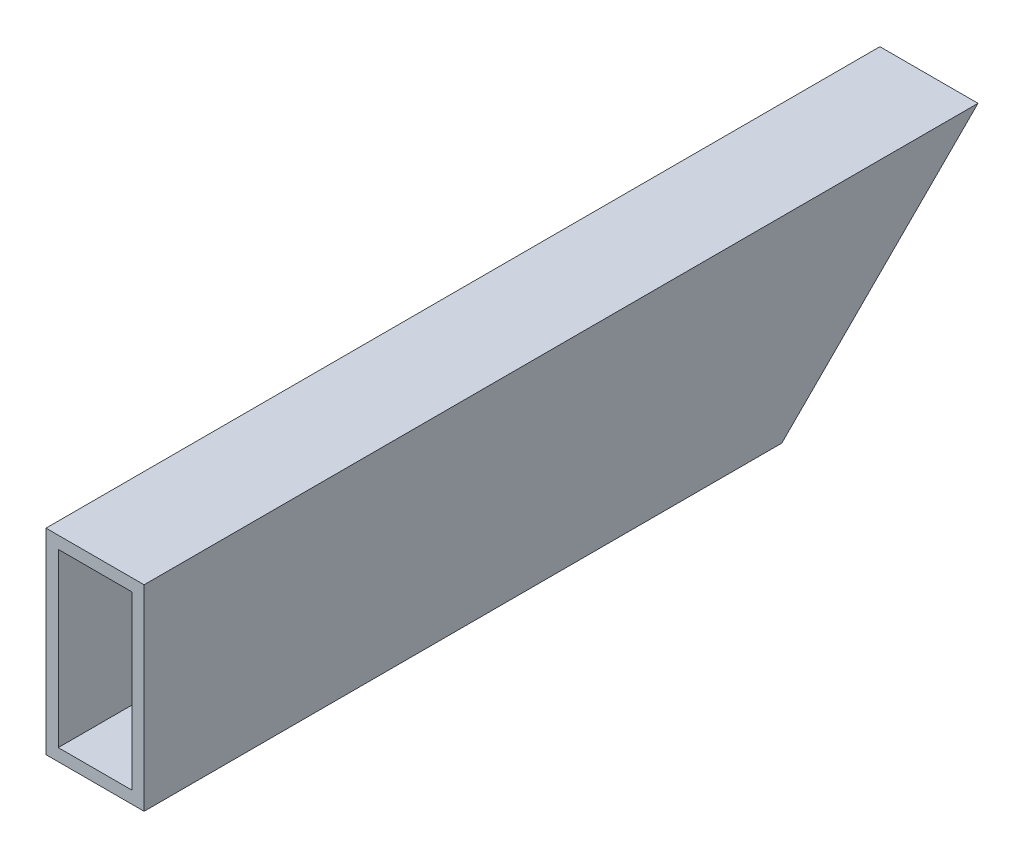
ISO-10303-21;
HEADER;
FILE_DESCRIPTION(('STEP AP214'),'2;1');
FILE_NAME('part.step','',(''),(''),'','','');
FILE_SCHEMA(('AUTOMOTIVE_DESIGN { 1 0 10303 214 1 1 1 1 }'));
ENDSEC;
DATA;
#1=APPLICATION_CONTEXT('core data for automotive mechanical design processes');
#2=APPLICATION_PROTOCOL_DEFINITION('international standard','automotive_design',2000,#1);
#3=PRODUCT_CONTEXT('',#1,'mechanical');
#4=PRODUCT('Part','Part','',(#3));
#5=PRODUCT_RELATED_PRODUCT_CATEGORY('part','',(#4));
#6=PRODUCT_DEFINITION_FORMATION('','',#4);
#7=PRODUCT_DEFINITION_CONTEXT('part definition',#1,'design');
#8=PRODUCT_DEFINITION('design','',#6,#7);
#9=PRODUCT_DEFINITION_SHAPE('','',#8);
#10=(LENGTH_UNIT() NAMED_UNIT(*) SI_UNIT(.MILLI.,.METRE.));
#11=(NAMED_UNIT(*) PLANE_ANGLE_UNIT() SI_UNIT($,.RADIAN.));
#12=(NAMED_UNIT(*) SI_UNIT($,.STERADIAN.) SOLID_ANGLE_UNIT());
#13=UNCERTAINTY_MEASURE_WITH_UNIT(LENGTH_MEASURE(1.E-05),#10,'distance_accuracy_value','');
#14=(GEOMETRIC_REPRESENTATION_CONTEXT(3) GLOBAL_UNCERTAINTY_ASSIGNED_CONTEXT((#13)) GLOBAL_UNIT_ASSIGNED_CONTEXT((#10,
#11,#12)) REPRESENTATION_CONTEXT('',''));
#15=CARTESIAN_POINT('',(0.,0.,0.));
#16=DIRECTION('',(0.,0.,1.));
#17=DIRECTION('',(1.,0.,0.));
#18=AXIS2_PLACEMENT_3D('',#15,#16,#17);
#19=CARTESIAN_POINT('',(0.,0.,215.9));
#20=DIRECTION('',(0.,0.,1.));
#21=DIRECTION('',(1.,0.,0.));
#22=AXIS2_PLACEMENT_3D('',#19,#20,#21);
#23=PLANE('',#22);
#24=DIRECTION('',(0.,-1.,0.));
#25=VECTOR('',#24,1.);
#26=CARTESIAN_POINT('',(-25.4,50.8,215.9));
#27=LINE('',#26,#25);
#28=CARTESIAN_POINT('',(-25.4,50.8,215.9));
#29=VERTEX_POINT('',#28);
#30=CARTESIAN_POINT('',(-25.4,0.,215.9));
#31=VERTEX_POINT('',#30);
#32=EDGE_CURVE('E128',#29,#31,#27,.T.);
#33=ORIENTED_EDGE('',*,*,#32,.T.);
#34=DIRECTION('',(1.,0.,0.));
#35=VECTOR('',#34,1.);
#36=CARTESIAN_POINT('',(-25.4,0.,215.9));
#37=LINE('',#36,#35);
#38=CARTESIAN_POINT('',(0.,0.,215.9));
#39=VERTEX_POINT('',#38);
#40=EDGE_CURVE('E116',#31,#39,#37,.T.);
#41=ORIENTED_EDGE('',*,*,#40,.T.);
#42=DIRECTION('',(0.,1.,0.));
#43=VECTOR('',#42,1.);
#44=CARTESIAN_POINT('',(0.,50.8,215.9));
#45=LINE('',#44,#43);
#46=CARTESIAN_POINT('',(0.,50.8,215.9));
#47=VERTEX_POINT('',#46);
#48=EDGE_CURVE('E131',#39,#47,#45,.T.);
#49=ORIENTED_EDGE('',*,*,#48,.T.);
#50=DIRECTION('',(-1.,0.,0.));
#51=VECTOR('',#50,1.);
#52=CARTESIAN_POINT('',(-25.4,50.8,215.9));
#53=LINE('',#52,#51);
#54=EDGE_CURVE('E125',#47,#29,#53,.T.);
#55=ORIENTED_EDGE('',*,*,#54,.T.);
#56=EDGE_LOOP('',(#33,#41,#49,#55));
#57=FACE_BOUND('',#56,.T.);
#58=DIRECTION('',(1.,0.,0.));
#59=VECTOR('',#58,1.);
#60=CARTESIAN_POINT('',(-22.225,3.175,215.9));
#61=LINE('',#60,#59);
#62=CARTESIAN_POINT('',(-22.225,3.175,215.9));
#63=VERTEX_POINT('',#62);
#64=CARTESIAN_POINT('',(-3.17499999999999,3.175,215.9));
#65=VERTEX_POINT('',#64);
#66=EDGE_CURVE('E148',#63,#65,#61,.T.);
#67=ORIENTED_EDGE('',*,*,#66,.F.);
#68=DIRECTION('',(0.,-1.,0.));
#69=VECTOR('',#68,1.);
#70=CARTESIAN_POINT('',(-22.225,47.625,215.9));
#71=LINE('',#70,#69);
#72=CARTESIAN_POINT('',(-22.225,47.625,215.9));
#73=VERTEX_POINT('',#72);
#74=EDGE_CURVE('E150',#73,#63,#71,.T.);
#75=ORIENTED_EDGE('',*,*,#74,.F.);
#76=DIRECTION('',(-1.,0.,0.));
#77=VECTOR('',#76,1.);
#78=CARTESIAN_POINT('',(-22.225,47.625,215.9));
#79=LINE('',#78,#77);
#80=CARTESIAN_POINT('',(-3.175,47.625,215.9));
#81=VERTEX_POINT('',#80);
#82=EDGE_CURVE('E144',#81,#73,#79,.T.);
#83=ORIENTED_EDGE('',*,*,#82,.F.);
#84=DIRECTION('',(0.,1.,0.));
#85=VECTOR('',#84,1.);
#86=CARTESIAN_POINT('',(-3.175,47.625,215.9));
#87=LINE('',#86,#85);
#88=EDGE_CURVE('E146',#65,#81,#87,.T.);
#89=ORIENTED_EDGE('',*,*,#88,.F.);
#90=EDGE_LOOP('',(#67,#75,#83,#89));
#91=FACE_BOUND('',#90,.T.);
#92=ADVANCED_FACE('F33',(#57,#91),#23,.T.);
#93=CARTESIAN_POINT('',(-25.4,50.8,215.9));
#94=DIRECTION('',(1.,0.,0.));
#95=DIRECTION('',(0.,0.,-1.));
#96=AXIS2_PLACEMENT_3D('',#93,#94,#95);
#97=PLANE('',#96);
#98=DIRECTION('',(0.,0.,-1.));
#99=VECTOR('',#98,1.);
#100=CARTESIAN_POINT('',(-25.4,50.8,215.9));
#101=LINE('',#100,#99);
#102=CARTESIAN_POINT('',(-25.4,50.8,0.));
#103=VERTEX_POINT('',#102);
#104=EDGE_CURVE('E113',#29,#103,#101,.T.);
#105=ORIENTED_EDGE('',*,*,#104,.T.);
#106=DIRECTION('',(0.,-0.707106781186554,0.707106781186541));
#107=VECTOR('',#106,1.);
#108=CARTESIAN_POINT('',(-25.4,50.8,0.));
#109=LINE('',#108,#107);
#110=CARTESIAN_POINT('',(-25.4,0.,50.7999999999991));
#111=VERTEX_POINT('',#110);
#112=EDGE_CURVE('E99',#103,#111,#109,.T.);
#113=ORIENTED_EDGE('',*,*,#112,.T.);
#114=DIRECTION('',(0.,0.,-1.));
#115=VECTOR('',#114,1.);
#116=CARTESIAN_POINT('',(-25.4,0.,215.9));
#117=LINE('',#116,#115);
#118=EDGE_CURVE('E41',#31,#111,#117,.T.);
#119=ORIENTED_EDGE('',*,*,#118,.F.);
#120=ORIENTED_EDGE('',*,*,#32,.F.);
#121=EDGE_LOOP('',(#105,#113,#119,#120));
#122=FACE_BOUND('',#121,.T.);
#123=ADVANCED_FACE('F35',(#122),#97,.F.);
#124=CARTESIAN_POINT('',(-25.4,0.,215.9));
#125=DIRECTION('',(0.,1.,0.));
#126=DIRECTION('',(0.,0.,1.));
#127=AXIS2_PLACEMENT_3D('',#124,#125,#126);
#128=PLANE('',#127);
#129=ORIENTED_EDGE('',*,*,#118,.T.);
#130=DIRECTION('',(1.,0.,0.));
#131=VECTOR('',#130,1.);
#132=CARTESIAN_POINT('',(-25.4,0.,50.7999999999991));
#133=LINE('',#132,#131);
#134=CARTESIAN_POINT('',(0.,0.,50.7999999999991));
#135=VERTEX_POINT('',#134);
#136=EDGE_CURVE('E96',#111,#135,#133,.T.);
#137=ORIENTED_EDGE('',*,*,#136,.T.);
#138=DIRECTION('',(0.,0.,-1.));
#139=VECTOR('',#138,1.);
#140=CARTESIAN_POINT('',(0.,0.,215.9));
#141=LINE('',#140,#139);
#142=EDGE_CURVE('E118',#39,#135,#141,.T.);
#143=ORIENTED_EDGE('',*,*,#142,.F.);
#144=ORIENTED_EDGE('',*,*,#40,.F.);
#145=EDGE_LOOP('',(#129,#137,#143,#144));
#146=FACE_BOUND('',#145,.T.);
#147=ADVANCED_FACE('F115',(#146),#128,.F.);
#148=CARTESIAN_POINT('',(0.,50.8,215.9));
#149=DIRECTION('',(-1.,0.,0.));
#150=DIRECTION('',(0.,-1.,0.));
#151=AXIS2_PLACEMENT_3D('',#148,#149,#150);
#152=PLANE('',#151);
#153=ORIENTED_EDGE('',*,*,#142,.T.);
#154=DIRECTION('',(0.,-0.707106781186554,0.707106781186541));
#155=VECTOR('',#154,1.);
#156=CARTESIAN_POINT('',(0.,50.8,0.));
#157=LINE('',#156,#155);
#158=CARTESIAN_POINT('',(0.,50.8,0.));
#159=VERTEX_POINT('',#158);
#160=EDGE_CURVE('E102',#159,#135,#157,.T.);
#161=ORIENTED_EDGE('',*,*,#160,.F.);
#162=DIRECTION('',(0.,0.,-1.));
#163=VECTOR('',#162,1.);
#164=CARTESIAN_POINT('',(0.,50.8,215.9));
#165=LINE('',#164,#163);
#166=EDGE_CURVE('E119',#47,#159,#165,.T.);
#167=ORIENTED_EDGE('',*,*,#166,.F.);
#168=ORIENTED_EDGE('',*,*,#48,.F.);
#169=EDGE_LOOP('',(#153,#161,#167,#168));
#170=FACE_BOUND('',#169,.T.);
#171=ADVANCED_FACE('F182',(#170),#152,.F.);
#172=CARTESIAN_POINT('',(-25.4,50.8,215.9));
#173=DIRECTION('',(0.,-1.,0.));
#174=DIRECTION('',(0.,0.,-1.));
#175=AXIS2_PLACEMENT_3D('',#172,#173,#174);
#176=PLANE('',#175);
#177=DIRECTION('',(-1.,0.,0.));
#178=VECTOR('',#177,1.);
#179=CARTESIAN_POINT('',(-25.4,50.8,0.));
#180=LINE('',#179,#178);
#181=EDGE_CURVE('E126',#159,#103,#180,.T.);
#182=ORIENTED_EDGE('',*,*,#181,.T.);
#183=ORIENTED_EDGE('',*,*,#104,.F.);
#184=ORIENTED_EDGE('',*,*,#54,.F.);
#185=ORIENTED_EDGE('',*,*,#166,.T.);
#186=EDGE_LOOP('',(#182,#183,#184,#185));
#187=FACE_BOUND('',#186,.T.);
#188=ADVANCED_FACE('F175',(#187),#176,.F.);
#189=CARTESIAN_POINT('',(-22.225,47.625,215.9));
#190=DIRECTION('',(1.,0.,0.));
#191=DIRECTION('',(0.,1.,0.));
#192=AXIS2_PLACEMENT_3D('',#189,#190,#191);
#193=PLANE('',#192);
#194=DIRECTION('',(0.,-0.707106781186554,0.707106781186541));
#195=VECTOR('',#194,1.);
#196=CARTESIAN_POINT('',(-22.225,-58.7375,109.537499999998));
#197=LINE('',#196,#195);
#198=CARTESIAN_POINT('',(-22.225,47.625,3.17499999999996));
#199=VERTEX_POINT('',#198);
#200=CARTESIAN_POINT('',(-22.225,3.175,47.6249999999992));
#201=VERTEX_POINT('',#200);
#202=EDGE_CURVE('E152',#199,#201,#197,.T.);
#203=ORIENTED_EDGE('',*,*,#202,.F.);
#204=DIRECTION('',(0.,0.,-1.));
#205=VECTOR('',#204,1.);
#206=CARTESIAN_POINT('',(-22.225,47.625,215.9));
#207=LINE('',#206,#205);
#208=EDGE_CURVE('E141',#73,#199,#207,.T.);
#209=ORIENTED_EDGE('',*,*,#208,.F.);
#210=ORIENTED_EDGE('',*,*,#74,.T.);
#211=DIRECTION('',(0.,0.,-1.));
#212=VECTOR('',#211,1.);
#213=CARTESIAN_POINT('',(-22.225,3.175,215.9));
#214=LINE('',#213,#212);
#215=EDGE_CURVE('E129',#63,#201,#214,.T.);
#216=ORIENTED_EDGE('',*,*,#215,.T.);
#217=EDGE_LOOP('',(#203,#209,#210,#216));
#218=FACE_BOUND('',#217,.T.);
#219=ADVANCED_FACE('F173',(#218),#193,.T.);
#220=CARTESIAN_POINT('',(-22.225,3.175,215.9));
#221=DIRECTION('',(0.,1.,0.));
#222=DIRECTION('',(0.,0.,1.));
#223=AXIS2_PLACEMENT_3D('',#220,#221,#222);
#224=PLANE('',#223);
#225=DIRECTION('',(1.,0.,0.));
#226=VECTOR('',#225,1.);
#227=CARTESIAN_POINT('',(-22.225,3.175,47.6249999999992));
#228=LINE('',#227,#226);
#229=CARTESIAN_POINT('',(-3.17499999999999,3.175,47.6249999999992));
#230=VERTEX_POINT('',#229);
#231=EDGE_CURVE('E154',#201,#230,#228,.T.);
#232=ORIENTED_EDGE('',*,*,#231,.F.);
#233=ORIENTED_EDGE('',*,*,#215,.F.);
#234=ORIENTED_EDGE('',*,*,#66,.T.);
#235=DIRECTION('',(0.,0.,-1.));
#236=VECTOR('',#235,1.);
#237=CARTESIAN_POINT('',(-3.17499999999999,3.175,215.9));
#238=LINE('',#237,#236);
#239=EDGE_CURVE('E137',#65,#230,#238,.T.);
#240=ORIENTED_EDGE('',*,*,#239,.T.);
#241=EDGE_LOOP('',(#232,#233,#234,#240));
#242=FACE_BOUND('',#241,.T.);
#243=ADVANCED_FACE('F165',(#242),#224,.T.);
#244=CARTESIAN_POINT('',(-3.175,47.625,215.9));
#245=DIRECTION('',(-1.,0.,0.));
#246=DIRECTION('',(0.,-1.,0.));
#247=AXIS2_PLACEMENT_3D('',#244,#245,#246);
#248=PLANE('',#247);
#249=DIRECTION('',(0.,0.707106781186554,-0.707106781186541));
#250=VECTOR('',#249,1.);
#251=CARTESIAN_POINT('',(-3.17499999999998,-58.7375,109.537499999998));
#252=LINE('',#251,#250);
#253=CARTESIAN_POINT('',(-3.175,47.625,3.17499999999996));
#254=VERTEX_POINT('',#253);
#255=EDGE_CURVE('E47',#230,#254,#252,.T.);
#256=ORIENTED_EDGE('',*,*,#255,.F.);
#257=ORIENTED_EDGE('',*,*,#239,.F.);
#258=ORIENTED_EDGE('',*,*,#88,.T.);
#259=DIRECTION('',(0.,0.,-1.));
#260=VECTOR('',#259,1.);
#261=CARTESIAN_POINT('',(-3.175,47.625,215.9));
#262=LINE('',#261,#260);
#263=EDGE_CURVE('E54',#81,#254,#262,.T.);
#264=ORIENTED_EDGE('',*,*,#263,.T.);
#265=EDGE_LOOP('',(#256,#257,#258,#264));
#266=FACE_BOUND('',#265,.T.);
#267=ADVANCED_FACE('F163',(#266),#248,.T.);
#268=CARTESIAN_POINT('',(-22.225,47.625,215.9));
#269=DIRECTION('',(0.,-1.,0.));
#270=DIRECTION('',(0.,0.,-1.));
#271=AXIS2_PLACEMENT_3D('',#268,#269,#270);
#272=PLANE('',#271);
#273=DIRECTION('',(-1.,0.,0.));
#274=VECTOR('',#273,1.);
#275=CARTESIAN_POINT('',(-22.225,47.625,3.17499999999996));
#276=LINE('',#275,#274);
#277=EDGE_CURVE('E11',#254,#199,#276,.T.);
#278=ORIENTED_EDGE('',*,*,#277,.F.);
#279=ORIENTED_EDGE('',*,*,#263,.F.);
#280=ORIENTED_EDGE('',*,*,#82,.T.);
#281=ORIENTED_EDGE('',*,*,#208,.T.);
#282=EDGE_LOOP('',(#278,#279,#280,#281));
#283=FACE_BOUND('',#282,.T.);
#284=ADVANCED_FACE('F171',(#283),#272,.T.);
#285=CARTESIAN_POINT('',(-25.4,50.8,0.));
#286=DIRECTION('',(0.,0.707106781186541,0.707106781186554));
#287=DIRECTION('',(0.,-0.707106781186554,0.707106781186541));
#288=AXIS2_PLACEMENT_3D('',#285,#286,#287);
#289=PLANE('',#288);
#290=ORIENTED_EDGE('',*,*,#202,.T.);
#291=ORIENTED_EDGE('',*,*,#231,.T.);
#292=ORIENTED_EDGE('',*,*,#255,.T.);
#293=ORIENTED_EDGE('',*,*,#277,.T.);
#294=EDGE_LOOP('',(#290,#291,#292,#293));
#295=FACE_BOUND('',#294,.T.);
#296=ORIENTED_EDGE('',*,*,#160,.T.);
#297=ORIENTED_EDGE('',*,*,#136,.F.);
#298=ORIENTED_EDGE('',*,*,#112,.F.);
#299=ORIENTED_EDGE('',*,*,#181,.F.);
#300=EDGE_LOOP('',(#296,#297,#298,#299));
#301=FACE_BOUND('',#300,.T.);
#302=ADVANCED_FACE('F98',(#295,#301),#289,.F.);
#303=CLOSED_SHELL('',(#92,#123,#147,#171,#188,#219,#243,#267,#284,#302));
#304=MANIFOLD_SOLID_BREP('B2',#303);
#305=ADVANCED_BREP_SHAPE_REPRESENTATION('',(#18,#304),#14);
#306=SHAPE_DEFINITION_REPRESENTATION(#9,#305);
ENDSEC;
END-ISO-10303-21;
